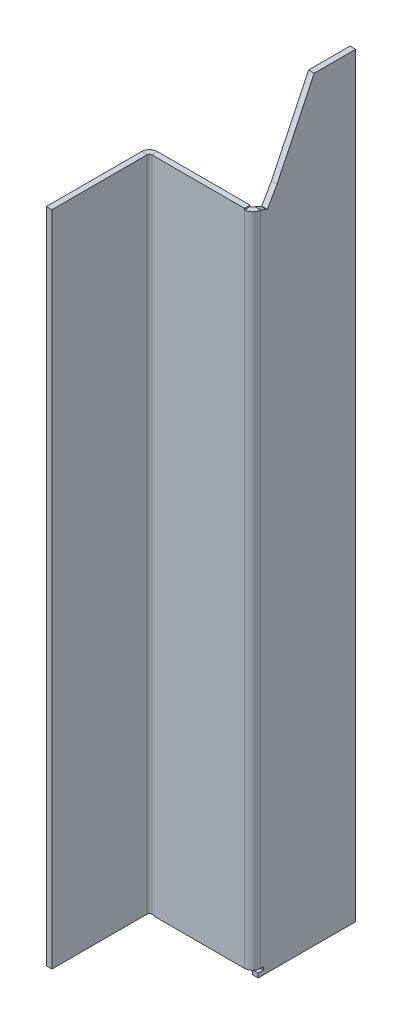
ISO-10303-21;
HEADER;
FILE_DESCRIPTION(('STEP AP214'),'2;1');
FILE_NAME('part.step','',(''),(''),'','','');
FILE_SCHEMA(('AUTOMOTIVE_DESIGN { 1 0 10303 214 1 1 1 1 }'));
ENDSEC;
DATA;
#1=APPLICATION_CONTEXT('core data for automotive mechanical design processes');
#2=APPLICATION_PROTOCOL_DEFINITION('international standard','automotive_design',2000,#1);
#3=PRODUCT_CONTEXT('',#1,'mechanical');
#4=PRODUCT('Part','Part','',(#3));
#5=PRODUCT_RELATED_PRODUCT_CATEGORY('part','',(#4));
#6=PRODUCT_DEFINITION_FORMATION('','',#4);
#7=PRODUCT_DEFINITION_CONTEXT('part definition',#1,'design');
#8=PRODUCT_DEFINITION('design','',#6,#7);
#9=PRODUCT_DEFINITION_SHAPE('','',#8);
#10=(LENGTH_UNIT() NAMED_UNIT(*) SI_UNIT(.MILLI.,.METRE.));
#11=(NAMED_UNIT(*) PLANE_ANGLE_UNIT() SI_UNIT($,.RADIAN.));
#12=(NAMED_UNIT(*) SI_UNIT($,.STERADIAN.) SOLID_ANGLE_UNIT());
#13=UNCERTAINTY_MEASURE_WITH_UNIT(LENGTH_MEASURE(1.E-05),#10,'distance_accuracy_value','');
#14=(GEOMETRIC_REPRESENTATION_CONTEXT(3) GLOBAL_UNCERTAINTY_ASSIGNED_CONTEXT((#13)) GLOBAL_UNIT_ASSIGNED_CONTEXT((#10,
#11,#12)) REPRESENTATION_CONTEXT('',''));
#15=CARTESIAN_POINT('',(0.,0.,0.));
#16=DIRECTION('',(0.,0.,1.));
#17=DIRECTION('',(1.,0.,0.));
#18=AXIS2_PLACEMENT_3D('',#15,#16,#17);
#19=CARTESIAN_POINT('',(-31.9366,89.,16.8527491419913));
#20=DIRECTION('',(0.,-1.,0.));
#21=DIRECTION('',(0.,0.,-1.));
#22=AXIS2_PLACEMENT_3D('',#19,#20,#21);
#23=PLANE('',#22);
#24=DIRECTION('',(0.,0.,-1.));
#25=VECTOR('',#24,1.);
#26=CARTESIAN_POINT('',(-31.2,89.,16.8527491419913));
#27=LINE('',#26,#25);
#28=CARTESIAN_POINT('',(-31.2,89.,16.8527491419913));
#29=VERTEX_POINT('',#28);
#30=CARTESIAN_POINT('',(-31.2,89.,15.1161491419913));
#31=VERTEX_POINT('',#30);
#32=EDGE_CURVE('E251',#29,#31,#27,.T.);
#33=ORIENTED_EDGE('',*,*,#32,.F.);
#34=DIRECTION('',(-1.,0.,0.));
#35=VECTOR('',#34,1.);
#36=CARTESIAN_POINT('',(-31.9366,89.,16.8527491419913));
#37=LINE('',#36,#35);
#38=CARTESIAN_POINT('',(-2.4732,89.,16.8527491419912));
#39=VERTEX_POINT('',#38);
#40=EDGE_CURVE('E276',#39,#29,#37,.T.);
#41=ORIENTED_EDGE('',*,*,#40,.F.);
#42=DIRECTION('',(0.,0.,1.));
#43=VECTOR('',#42,1.);
#44=CARTESIAN_POINT('',(-2.4732,89.,15.1161491419912));
#45=LINE('',#44,#43);
#46=CARTESIAN_POINT('',(-2.4732,89.,15.1161491419912));
#47=VERTEX_POINT('',#46);
#48=EDGE_CURVE('E268',#47,#39,#45,.T.);
#49=ORIENTED_EDGE('',*,*,#48,.F.);
#50=DIRECTION('',(-1.,0.,0.));
#51=VECTOR('',#50,1.);
#52=CARTESIAN_POINT('',(-31.9366,89.,15.1161491419913));
#53=LINE('',#52,#51);
#54=EDGE_CURVE('E275',#47,#31,#53,.T.);
#55=ORIENTED_EDGE('',*,*,#54,.T.);
#56=EDGE_LOOP('',(#33,#41,#49,#55));
#57=FACE_BOUND('',#56,.T.);
#58=ADVANCED_FACE('F39',(#57),#23,.F.);
#59=CARTESIAN_POINT('',(-1.73659999999996,-114.862531118843,16.8527491419912));
#60=DIRECTION('',(0.,1.,0.));
#61=DIRECTION('',(0.,0.,1.));
#62=AXIS2_PLACEMENT_3D('',#59,#60,#61);
#63=PLANE('',#62);
#64=DIRECTION('',(0.,0.,1.));
#65=VECTOR('',#64,1.);
#66=CARTESIAN_POINT('',(-30.3317,-114.862531118843,16.8527491419912));
#67=LINE('',#66,#65);
#68=CARTESIAN_POINT('',(-30.3317,-114.862531118843,15.1161491419913));
#69=VERTEX_POINT('',#68);
#70=CARTESIAN_POINT('',(-30.3317,-114.862531118843,16.8527491419913));
#71=VERTEX_POINT('',#70);
#72=EDGE_CURVE('E257',#69,#71,#67,.T.);
#73=ORIENTED_EDGE('',*,*,#72,.F.);
#74=DIRECTION('',(1.,0.,0.));
#75=VECTOR('',#74,1.);
#76=CARTESIAN_POINT('',(-1.73659999999996,-114.862531118843,15.1161491419912));
#77=LINE('',#76,#75);
#78=CARTESIAN_POINT('',(-2.47319999999998,-114.862531118843,15.1161491419912));
#79=VERTEX_POINT('',#78);
#80=EDGE_CURVE('E280',#69,#79,#77,.T.);
#81=ORIENTED_EDGE('',*,*,#80,.T.);
#82=DIRECTION('',(0.,0.,1.));
#83=VECTOR('',#82,1.);
#84=CARTESIAN_POINT('',(-2.47319999999996,-114.862531118843,15.1161491419912));
#85=LINE('',#84,#83);
#86=CARTESIAN_POINT('',(-2.47319999999996,-114.862531118843,16.8527491419912));
#87=VERTEX_POINT('',#86);
#88=EDGE_CURVE('E264',#79,#87,#85,.T.);
#89=ORIENTED_EDGE('',*,*,#88,.T.);
#90=DIRECTION('',(1.,0.,0.));
#91=VECTOR('',#90,1.);
#92=CARTESIAN_POINT('',(-1.73659999999996,-114.862531118843,16.8527491419912));
#93=LINE('',#92,#91);
#94=EDGE_CURVE('E279',#71,#87,#93,.T.);
#95=ORIENTED_EDGE('',*,*,#94,.F.);
#96=EDGE_LOOP('',(#73,#81,#89,#95));
#97=FACE_BOUND('',#96,.T.);
#98=ADVANCED_FACE('F416',(#97),#63,.F.);
#99=CARTESIAN_POINT('',(0.,0.,16.8527491419912));
#100=DIRECTION('',(0.,0.,-1.));
#101=DIRECTION('',(-1.,0.,0.));
#102=AXIS2_PLACEMENT_3D('',#99,#100,#101);
#103=PLANE('',#102);
#104=DIRECTION('',(0.,1.,0.));
#105=VECTOR('',#104,1.);
#106=CARTESIAN_POINT('',(-30.3317,-115.530831118843,16.8527491419913));
#107=LINE('',#106,#105);
#108=CARTESIAN_POINT('',(-30.3317,-114.662531118843,16.8527491419913));
#109=VERTEX_POINT('',#108);
#110=EDGE_CURVE('E255',#71,#109,#107,.T.);
#111=ORIENTED_EDGE('',*,*,#110,.F.);
#112=ORIENTED_EDGE('',*,*,#94,.T.);
#113=DIRECTION('',(0.,1.,0.));
#114=VECTOR('',#113,1.);
#115=CARTESIAN_POINT('',(-2.47319999999997,88.5941398939917,16.8527491419912));
#116=LINE('',#115,#114);
#117=CARTESIAN_POINT('',(-2.47319999999997,88.5941398939917,16.8527491419912));
#118=VERTEX_POINT('',#117);
#119=EDGE_CURVE('E293',#87,#118,#116,.T.);
#120=ORIENTED_EDGE('',*,*,#119,.T.);
#121=DIRECTION('',(0.,-1.,0.));
#122=VECTOR('',#121,1.);
#123=CARTESIAN_POINT('',(-2.47319999999998,0.,16.8527491419912));
#124=LINE('',#123,#122);
#125=EDGE_CURVE('E271',#39,#118,#124,.T.);
#126=ORIENTED_EDGE('',*,*,#125,.F.);
#127=ORIENTED_EDGE('',*,*,#40,.T.);
#128=DIRECTION('',(0.,-1.,0.));
#129=VECTOR('',#128,1.);
#130=CARTESIAN_POINT('',(-31.2,-114.662531118843,16.8527491419913));
#131=LINE('',#130,#129);
#132=CARTESIAN_POINT('',(-31.2,-114.662531118843,16.8527491419913));
#133=VERTEX_POINT('',#132);
#134=EDGE_CURVE('E248',#133,#29,#131,.F.);
#135=ORIENTED_EDGE('',*,*,#134,.F.);
#136=DIRECTION('',(-1.,0.,0.));
#137=VECTOR('',#136,1.);
#138=CARTESIAN_POINT('',(-30.3317,-114.662531118843,16.8527491419913));
#139=LINE('',#138,#137);
#140=EDGE_CURVE('E258',#109,#133,#139,.T.);
#141=ORIENTED_EDGE('',*,*,#140,.F.);
#142=EDGE_LOOP('',(#111,#112,#120,#126,#127,#135,#141));
#143=FACE_BOUND('',#142,.T.);
#144=ADVANCED_FACE('F413',(#143),#103,.F.);
#145=CARTESIAN_POINT('',(0.,0.,15.1161491419912));
#146=DIRECTION('',(0.,0.,-1.));
#147=DIRECTION('',(-1.,0.,0.));
#148=AXIS2_PLACEMENT_3D('',#145,#146,#147);
#149=PLANE('',#148);
#150=ORIENTED_EDGE('',*,*,#80,.F.);
#151=DIRECTION('',(0.,1.,0.));
#152=VECTOR('',#151,1.);
#153=CARTESIAN_POINT('',(-30.3317,0.,15.1161491419913));
#154=LINE('',#153,#152);
#155=CARTESIAN_POINT('',(-30.3317,-114.662531118843,15.1161491419913));
#156=VERTEX_POINT('',#155);
#157=EDGE_CURVE('E11',#69,#156,#154,.T.);
#158=ORIENTED_EDGE('',*,*,#157,.T.);
#159=DIRECTION('',(-1.,0.,0.));
#160=VECTOR('',#159,1.);
#161=CARTESIAN_POINT('',(0.,-114.662531118843,15.1161491419912));
#162=LINE('',#161,#160);
#163=CARTESIAN_POINT('',(-31.2,-114.662531118843,15.1161491419913));
#164=VERTEX_POINT('',#163);
#165=EDGE_CURVE('E47',#156,#164,#162,.T.);
#166=ORIENTED_EDGE('',*,*,#165,.T.);
#167=DIRECTION('',(0.,-1.,0.));
#168=VECTOR('',#167,1.);
#169=CARTESIAN_POINT('',(-31.2,-114.662531118843,15.1161491419913));
#170=LINE('',#169,#168);
#171=EDGE_CURVE('E198',#164,#31,#170,.F.);
#172=ORIENTED_EDGE('',*,*,#171,.T.);
#173=ORIENTED_EDGE('',*,*,#54,.F.);
#174=DIRECTION('',(0.,1.,0.));
#175=VECTOR('',#174,1.);
#176=CARTESIAN_POINT('',(-2.47319999999996,-114.862531118843,15.1161491419912));
#177=LINE('',#176,#175);
#178=CARTESIAN_POINT('',(-2.4732,88.5941398939917,15.1161491419912));
#179=VERTEX_POINT('',#178);
#180=EDGE_CURVE('E269',#179,#47,#177,.T.);
#181=ORIENTED_EDGE('',*,*,#180,.F.);
#182=EDGE_CURVE('E265',#79,#179,#177,.T.);
#183=ORIENTED_EDGE('',*,*,#182,.F.);
#184=EDGE_LOOP('',(#150,#158,#166,#172,#173,#181,#183));
#185=FACE_BOUND('',#184,.T.);
#186=ADVANCED_FACE('F401',(#185),#149,.T.);
#187=CARTESIAN_POINT('',(-1.7366,-117.062531118843,15.1161491419912));
#188=DIRECTION('',(0.,0.,1.));
#189=DIRECTION('',(1.,0.,0.));
#190=AXIS2_PLACEMENT_3D('',#187,#188,#189);
#191=PLANE('',#190);
#192=DIRECTION('',(0.,-1.,0.));
#193=VECTOR('',#192,1.);
#194=CARTESIAN_POINT('',(0.,-117.062531118843,15.1161491419912));
#195=LINE('',#194,#193);
#196=CARTESIAN_POINT('',(0.,-115.730831118843,15.1161491419912));
#197=VERTEX_POINT('',#196);
#198=CARTESIAN_POINT('',(0.,-117.062531118843,15.1161491419912));
#199=VERTEX_POINT('',#198);
#200=EDGE_CURVE('E372',#197,#199,#195,.T.);
#201=ORIENTED_EDGE('',*,*,#200,.F.);
#202=DIRECTION('',(1.,0.,0.));
#203=VECTOR('',#202,1.);
#204=CARTESIAN_POINT('',(-1.73659999999998,-115.730831118843,15.1161491419912));
#205=LINE('',#204,#203);
#206=CARTESIAN_POINT('',(-1.7366,-115.730831118843,15.1161491419912));
#207=VERTEX_POINT('',#206);
#208=EDGE_CURVE('E324',#207,#197,#205,.T.);
#209=ORIENTED_EDGE('',*,*,#208,.F.);
#210=DIRECTION('',(0.,-1.,0.));
#211=VECTOR('',#210,1.);
#212=CARTESIAN_POINT('',(-1.7366,-117.062531118843,15.1161491419912));
#213=LINE('',#212,#211);
#214=CARTESIAN_POINT('',(-1.7366,-117.062531118843,15.1161491419912));
#215=VERTEX_POINT('',#214);
#216=EDGE_CURVE('E350',#207,#215,#213,.T.);
#217=ORIENTED_EDGE('',*,*,#216,.T.);
#218=DIRECTION('',(1.,0.,0.));
#219=VECTOR('',#218,1.);
#220=CARTESIAN_POINT('',(-1.7366,-117.062531118843,15.1161491419912));
#221=LINE('',#220,#219);
#222=EDGE_CURVE('E379',#215,#199,#221,.T.);
#223=ORIENTED_EDGE('',*,*,#222,.T.);
#224=EDGE_LOOP('',(#201,#209,#217,#223));
#225=FACE_BOUND('',#224,.T.);
#226=ADVANCED_FACE('F514',(#225),#191,.T.);
#227=CARTESIAN_POINT('',(-1.7366,87.6777832599046,12.429418015997));
#228=DIRECTION('',(0.,0.905060323174692,-0.425283213182605));
#229=DIRECTION('',(0.,0.425283213182605,0.905060323174693));
#230=AXIS2_PLACEMENT_3D('',#227,#228,#229);
#231=PLANE('',#230);
#232=DIRECTION('',(0.,0.425283213182605,0.905060323174693));
#233=VECTOR('',#232,1.);
#234=CARTESIAN_POINT('',(-1.7366,87.6777832599046,12.429418015997));
#235=LINE('',#234,#233);
#236=CARTESIAN_POINT('',(-1.7366,87.6777832599046,12.429418015997));
#237=VERTEX_POINT('',#236);
#238=CARTESIAN_POINT('',(-1.7366,88.5941398939917,14.3795491419912));
#239=VERTEX_POINT('',#238);
#240=EDGE_CURVE('E347',#237,#239,#235,.T.);
#241=ORIENTED_EDGE('',*,*,#240,.T.);
#242=DIRECTION('',(1.,0.,0.));
#243=VECTOR('',#242,1.);
#244=CARTESIAN_POINT('',(-1.73659999999995,88.5941398939917,14.3795491419912));
#245=LINE('',#244,#243);
#246=CARTESIAN_POINT('',(0.,88.5941398939917,14.3795491419912));
#247=VERTEX_POINT('',#246);
#248=EDGE_CURVE('E292',#239,#247,#245,.T.);
#249=ORIENTED_EDGE('',*,*,#248,.T.);
#250=DIRECTION('',(0.,0.425283213182605,0.905060323174693));
#251=VECTOR('',#250,1.);
#252=CARTESIAN_POINT('',(0.,87.6777832599046,12.429418015997));
#253=LINE('',#252,#251);
#254=CARTESIAN_POINT('',(0.,87.6777832599046,12.429418015997));
#255=VERTEX_POINT('',#254);
#256=EDGE_CURVE('E370',#255,#247,#253,.T.);
#257=ORIENTED_EDGE('',*,*,#256,.F.);
#258=DIRECTION('',(1.,0.,0.));
#259=VECTOR('',#258,1.);
#260=CARTESIAN_POINT('',(-1.7366,87.6777832599046,12.429418015997));
#261=LINE('',#260,#259);
#262=EDGE_CURVE('E382',#237,#255,#261,.T.);
#263=ORIENTED_EDGE('',*,*,#262,.F.);
#264=EDGE_LOOP('',(#241,#249,#257,#263));
#265=FACE_BOUND('',#264,.T.);
#266=ADVANCED_FACE('F439',(#265),#231,.T.);
#267=CARTESIAN_POINT('',(-1.7366,0.,0.));
#268=DIRECTION('',(-1.,0.,0.));
#269=DIRECTION('',(0.,0.,1.));
#270=AXIS2_PLACEMENT_3D('',#267,#268,#269);
#271=PLANE('',#270);
#272=DIRECTION('',(0.,0.,-1.));
#273=VECTOR('',#272,1.);
#274=CARTESIAN_POINT('',(-1.73659999999995,-114.862531118843,14.3795491419912));
#275=LINE('',#274,#273);
#276=CARTESIAN_POINT('',(-1.7366,-114.862531118843,14.3795491419912));
#277=VERTEX_POINT('',#276);
#278=CARTESIAN_POINT('',(-1.7366,-114.862531118843,13.5112491419912));
#279=VERTEX_POINT('',#278);
#280=EDGE_CURVE('E62',#277,#279,#275,.T.);
#281=ORIENTED_EDGE('',*,*,#280,.F.);
#282=DIRECTION('',(0.,1.,0.));
#283=VECTOR('',#282,1.);
#284=CARTESIAN_POINT('',(-1.73659999999995,88.5941398939917,14.3795491419912));
#285=LINE('',#284,#283);
#286=EDGE_CURVE('E301',#239,#277,#285,.F.);
#287=ORIENTED_EDGE('',*,*,#286,.F.);
#288=ORIENTED_EDGE('',*,*,#240,.F.);
#289=DIRECTION('',(0.,0.13938622121451,0.990238093256132));
#290=VECTOR('',#289,1.);
#291=CARTESIAN_POINT('',(-1.7366,87.6560709520587,12.275167802926));
#292=LINE('',#291,#290);
#293=CARTESIAN_POINT('',(-1.7366,87.6560709520587,12.275167802926));
#294=VERTEX_POINT('',#293);
#295=EDGE_CURVE('E344',#294,#237,#292,.T.);
#296=ORIENTED_EDGE('',*,*,#295,.F.);
#297=DIRECTION('',(0.,-0.867078286675618,0.498171902836436));
#298=VECTOR('',#297,1.);
#299=CARTESIAN_POINT('',(-1.7366,92.9042264348046,9.25988804860881));
#300=LINE('',#299,#298);
#301=CARTESIAN_POINT('',(-1.7366,92.9042264348046,9.25988804860881));
#302=VERTEX_POINT('',#301);
#303=EDGE_CURVE('E341',#302,#294,#300,.T.);
#304=ORIENTED_EDGE('',*,*,#303,.F.);
#305=DIRECTION('',(0.,-0.90185435907009,0.432040177560233));
#306=VECTOR('',#305,1.);
#307=CARTESIAN_POINT('',(-1.7366,116.937468881157,-2.2534192048779));
#308=LINE('',#307,#306);
#309=CARTESIAN_POINT('',(-1.7366,116.937468881157,-2.2534192048779));
#310=VERTEX_POINT('',#309);
#311=EDGE_CURVE('E338',#310,#302,#308,.T.);
#312=ORIENTED_EDGE('',*,*,#311,.F.);
#313=DIRECTION('',(0.,0.,1.));
#314=VECTOR('',#313,1.);
#315=CARTESIAN_POINT('',(-1.7366,116.937468881157,-2.2534192048779));
#316=LINE('',#315,#314);
#317=CARTESIAN_POINT('',(-1.7366,116.937468881157,-15.1));
#318=VERTEX_POINT('',#317);
#319=EDGE_CURVE('E334',#318,#310,#316,.T.);
#320=ORIENTED_EDGE('',*,*,#319,.F.);
#321=DIRECTION('',(0.,1.,0.));
#322=VECTOR('',#321,1.);
#323=CARTESIAN_POINT('',(-1.7366,-117.062531118843,-15.1));
#324=LINE('',#323,#322);
#325=CARTESIAN_POINT('',(-1.7366,-117.062531118843,-15.1));
#326=VERTEX_POINT('',#325);
#327=EDGE_CURVE('E331',#326,#318,#324,.T.);
#328=ORIENTED_EDGE('',*,*,#327,.F.);
#329=DIRECTION('',(0.,0.,-1.));
#330=VECTOR('',#329,1.);
#331=CARTESIAN_POINT('',(-1.7366,-117.062531118843,15.1161491419912));
#332=LINE('',#331,#330);
#333=EDGE_CURVE('E352',#215,#326,#332,.T.);
#334=ORIENTED_EDGE('',*,*,#333,.F.);
#335=ORIENTED_EDGE('',*,*,#216,.F.);
#336=DIRECTION('',(0.,0.,1.));
#337=VECTOR('',#336,1.);
#338=CARTESIAN_POINT('',(-1.73659999999995,-115.730831118843,13.5112491419912));
#339=LINE('',#338,#337);
#340=CARTESIAN_POINT('',(-1.7366,-115.730831118843,13.5112491419912));
#341=VERTEX_POINT('',#340);
#342=EDGE_CURVE('E321',#341,#207,#339,.T.);
#343=ORIENTED_EDGE('',*,*,#342,.F.);
#344=DIRECTION('',(0.,-1.,0.));
#345=VECTOR('',#344,1.);
#346=CARTESIAN_POINT('',(-1.73659999999995,-114.862531118843,13.5112491419912));
#347=LINE('',#346,#345);
#348=EDGE_CURVE('E317',#279,#341,#347,.T.);
#349=ORIENTED_EDGE('',*,*,#348,.F.);
#350=EDGE_LOOP('',(#281,#287,#288,#296,#304,#312,#320,#328,#334,#335,#343,#349));
#351=FACE_BOUND('',#350,.T.);
#352=ADVANCED_FACE('F435',(#351),#271,.T.);
#353=CARTESIAN_POINT('',(0.,0.,0.));
#354=DIRECTION('',(-1.,0.,0.));
#355=DIRECTION('',(0.,0.,1.));
#356=AXIS2_PLACEMENT_3D('',#353,#354,#355);
#357=PLANE('',#356);
#358=DIRECTION('',(0.,1.,0.));
#359=VECTOR('',#358,1.);
#360=CARTESIAN_POINT('',(0.,88.5941398939917,14.3795491419912));
#361=LINE('',#360,#359);
#362=CARTESIAN_POINT('',(0.,-114.862531118843,14.3795491419912));
#363=VERTEX_POINT('',#362);
#364=EDGE_CURVE('E286',#247,#363,#361,.F.);
#365=ORIENTED_EDGE('',*,*,#364,.T.);
#366=DIRECTION('',(0.,0.,1.));
#367=VECTOR('',#366,1.);
#368=CARTESIAN_POINT('',(0.,-114.862531118843,0.));
#369=LINE('',#368,#367);
#370=CARTESIAN_POINT('',(0.,-114.862531118843,13.5112491419912));
#371=VERTEX_POINT('',#370);
#372=EDGE_CURVE('E396',#371,#363,#369,.T.);
#373=ORIENTED_EDGE('',*,*,#372,.F.);
#374=DIRECTION('',(0.,1.,0.));
#375=VECTOR('',#374,1.);
#376=CARTESIAN_POINT('',(0.,0.,13.5112491419912));
#377=LINE('',#376,#375);
#378=CARTESIAN_POINT('',(0.,-115.730831118843,13.5112491419912));
#379=VERTEX_POINT('',#378);
#380=EDGE_CURVE('E393',#379,#371,#377,.T.);
#381=ORIENTED_EDGE('',*,*,#380,.F.);
#382=DIRECTION('',(0.,0.,-1.));
#383=VECTOR('',#382,1.);
#384=CARTESIAN_POINT('',(0.,-115.730831118843,0.));
#385=LINE('',#384,#383);
#386=EDGE_CURVE('E378',#197,#379,#385,.T.);
#387=ORIENTED_EDGE('',*,*,#386,.F.);
#388=ORIENTED_EDGE('',*,*,#200,.T.);
#389=DIRECTION('',(0.,0.,-1.));
#390=VECTOR('',#389,1.);
#391=CARTESIAN_POINT('',(0.,-117.062531118843,15.1161491419912));
#392=LINE('',#391,#390);
#393=CARTESIAN_POINT('',(0.,-117.062531118843,-15.1));
#394=VERTEX_POINT('',#393);
#395=EDGE_CURVE('E335',#199,#394,#392,.T.);
#396=ORIENTED_EDGE('',*,*,#395,.T.);
#397=DIRECTION('',(0.,1.,0.));
#398=VECTOR('',#397,1.);
#399=CARTESIAN_POINT('',(0.,-117.062531118843,-15.1));
#400=LINE('',#399,#398);
#401=CARTESIAN_POINT('',(0.,116.937468881157,-15.1));
#402=VERTEX_POINT('',#401);
#403=EDGE_CURVE('E316',#394,#402,#400,.T.);
#404=ORIENTED_EDGE('',*,*,#403,.T.);
#405=DIRECTION('',(0.,0.,1.));
#406=VECTOR('',#405,1.);
#407=CARTESIAN_POINT('',(0.,116.937468881157,-2.2534192048779));
#408=LINE('',#407,#406);
#409=CARTESIAN_POINT('',(0.,116.937468881157,-2.2534192048779));
#410=VERTEX_POINT('',#409);
#411=EDGE_CURVE('E358',#402,#410,#408,.T.);
#412=ORIENTED_EDGE('',*,*,#411,.T.);
#413=DIRECTION('',(0.,-0.90185435907009,0.432040177560233));
#414=VECTOR('',#413,1.);
#415=CARTESIAN_POINT('',(0.,116.937468881157,-2.2534192048779));
#416=LINE('',#415,#414);
#417=CARTESIAN_POINT('',(0.,92.9042264348046,9.25988804860881));
#418=VERTEX_POINT('',#417);
#419=EDGE_CURVE('E361',#410,#418,#416,.T.);
#420=ORIENTED_EDGE('',*,*,#419,.T.);
#421=DIRECTION('',(0.,-0.867078286675618,0.498171902836436));
#422=VECTOR('',#421,1.);
#423=CARTESIAN_POINT('',(0.,92.9042264348046,9.25988804860881));
#424=LINE('',#423,#422);
#425=CARTESIAN_POINT('',(0.,87.6560709520587,12.275167802926));
#426=VERTEX_POINT('',#425);
#427=EDGE_CURVE('E364',#418,#426,#424,.T.);
#428=ORIENTED_EDGE('',*,*,#427,.T.);
#429=DIRECTION('',(0.,0.13938622121451,0.990238093256132));
#430=VECTOR('',#429,1.);
#431=CARTESIAN_POINT('',(0.,87.6560709520587,12.275167802926));
#432=LINE('',#431,#430);
#433=EDGE_CURVE('E367',#426,#255,#432,.T.);
#434=ORIENTED_EDGE('',*,*,#433,.T.);
#435=ORIENTED_EDGE('',*,*,#256,.T.);
#436=EDGE_LOOP('',(#365,#373,#381,#387,#388,#396,#404,#412,#420,#428,#434,#435));
#437=FACE_BOUND('',#436,.T.);
#438=ADVANCED_FACE('F505',(#437),#357,.F.);
#439=CARTESIAN_POINT('',(-1.7366,-117.062531118843,-15.1));
#440=DIRECTION('',(0.,0.,-1.));
#441=DIRECTION('',(-1.,0.,0.));
#442=AXIS2_PLACEMENT_3D('',#439,#440,#441);
#443=PLANE('',#442);
#444=ORIENTED_EDGE('',*,*,#403,.F.);
#445=DIRECTION('',(1.,0.,0.));
#446=VECTOR('',#445,1.);
#447=CARTESIAN_POINT('',(-1.7366,-117.062531118843,-15.1));
#448=LINE('',#447,#446);
#449=EDGE_CURVE('E376',#326,#394,#448,.T.);
#450=ORIENTED_EDGE('',*,*,#449,.F.);
#451=ORIENTED_EDGE('',*,*,#327,.T.);
#452=DIRECTION('',(1.,0.,0.));
#453=VECTOR('',#452,1.);
#454=CARTESIAN_POINT('',(-1.7366,116.937468881157,-15.1));
#455=LINE('',#454,#453);
#456=EDGE_CURVE('E355',#318,#402,#455,.T.);
#457=ORIENTED_EDGE('',*,*,#456,.T.);
#458=EDGE_LOOP('',(#444,#450,#451,#457));
#459=FACE_BOUND('',#458,.T.);
#460=ADVANCED_FACE('F41',(#459),#443,.T.);
#461=CARTESIAN_POINT('',(-1.7366,-117.062531118843,15.1161491419912));
#462=DIRECTION('',(0.,-1.,0.));
#463=DIRECTION('',(0.,0.,-1.));
#464=AXIS2_PLACEMENT_3D('',#461,#462,#463);
#465=PLANE('',#464);
#466=ORIENTED_EDGE('',*,*,#395,.F.);
#467=ORIENTED_EDGE('',*,*,#222,.F.);
#468=ORIENTED_EDGE('',*,*,#333,.T.);
#469=ORIENTED_EDGE('',*,*,#449,.T.);
#470=EDGE_LOOP('',(#466,#467,#468,#469));
#471=FACE_BOUND('',#470,.T.);
#472=ADVANCED_FACE('F509',(#471),#465,.T.);
#473=CARTESIAN_POINT('',(-1.7366,87.6560709520587,12.275167802926));
#474=DIRECTION('',(0.,0.990238093256132,-0.13938622121451));
#475=DIRECTION('',(0.,0.13938622121451,0.990238093256132));
#476=AXIS2_PLACEMENT_3D('',#473,#474,#475);
#477=PLANE('',#476);
#478=ORIENTED_EDGE('',*,*,#433,.F.);
#479=DIRECTION('',(1.,0.,0.));
#480=VECTOR('',#479,1.);
#481=CARTESIAN_POINT('',(-1.7366,87.6560709520587,12.275167802926));
#482=LINE('',#481,#480);
#483=EDGE_CURVE('E384',#294,#426,#482,.T.);
#484=ORIENTED_EDGE('',*,*,#483,.F.);
#485=ORIENTED_EDGE('',*,*,#295,.T.);
#486=ORIENTED_EDGE('',*,*,#262,.T.);
#487=EDGE_LOOP('',(#478,#484,#485,#486));
#488=FACE_BOUND('',#487,.T.);
#489=ADVANCED_FACE('F512',(#488),#477,.T.);
#490=CARTESIAN_POINT('',(-1.7366,92.9042264348046,9.25988804860881));
#491=DIRECTION('',(0.,0.498171902836436,0.867078286675618));
#492=DIRECTION('',(0.,-0.867078286675618,0.498171902836436));
#493=AXIS2_PLACEMENT_3D('',#490,#491,#492);
#494=PLANE('',#493);
#495=ORIENTED_EDGE('',*,*,#427,.F.);
#496=DIRECTION('',(1.,0.,0.));
#497=VECTOR('',#496,1.);
#498=CARTESIAN_POINT('',(-1.7366,92.9042264348046,9.25988804860881));
#499=LINE('',#498,#497);
#500=EDGE_CURVE('E386',#302,#418,#499,.T.);
#501=ORIENTED_EDGE('',*,*,#500,.F.);
#502=ORIENTED_EDGE('',*,*,#303,.T.);
#503=ORIENTED_EDGE('',*,*,#483,.T.);
#504=EDGE_LOOP('',(#495,#501,#502,#503));
#505=FACE_BOUND('',#504,.T.);
#506=ADVANCED_FACE('F522',(#505),#494,.T.);
#507=CARTESIAN_POINT('',(-1.7366,116.937468881157,-2.2534192048779));
#508=DIRECTION('',(0.,0.432040177560233,0.90185435907009));
#509=DIRECTION('',(0.,-0.90185435907009,0.432040177560233));
#510=AXIS2_PLACEMENT_3D('',#507,#508,#509);
#511=PLANE('',#510);
#512=ORIENTED_EDGE('',*,*,#419,.F.);
#513=DIRECTION('',(1.,0.,0.));
#514=VECTOR('',#513,1.);
#515=CARTESIAN_POINT('',(-1.7366,116.937468881157,-2.2534192048779));
#516=LINE('',#515,#514);
#517=EDGE_CURVE('E388',#310,#410,#516,.T.);
#518=ORIENTED_EDGE('',*,*,#517,.F.);
#519=ORIENTED_EDGE('',*,*,#311,.T.);
#520=ORIENTED_EDGE('',*,*,#500,.T.);
#521=EDGE_LOOP('',(#512,#518,#519,#520));
#522=FACE_BOUND('',#521,.T.);
#523=ADVANCED_FACE('F526',(#522),#511,.T.);
#524=CARTESIAN_POINT('',(-1.7366,116.937468881157,-2.2534192048779));
#525=DIRECTION('',(0.,1.,0.));
#526=DIRECTION('',(0.,0.,1.));
#527=AXIS2_PLACEMENT_3D('',#524,#525,#526);
#528=PLANE('',#527);
#529=ORIENTED_EDGE('',*,*,#411,.F.);
#530=ORIENTED_EDGE('',*,*,#456,.F.);
#531=ORIENTED_EDGE('',*,*,#319,.T.);
#532=ORIENTED_EDGE('',*,*,#517,.T.);
#533=EDGE_LOOP('',(#529,#530,#531,#532));
#534=FACE_BOUND('',#533,.T.);
#535=ADVANCED_FACE('F502',(#534),#528,.T.);
#536=CARTESIAN_POINT('',(-1.73659999999995,-114.862531118843,14.3795491419912));
#537=DIRECTION('',(0.,-1.,0.));
#538=DIRECTION('',(0.,0.,-1.));
#539=AXIS2_PLACEMENT_3D('',#536,#537,#538);
#540=PLANE('',#539);
#541=DIRECTION('',(1.,0.,0.));
#542=VECTOR('',#541,1.);
#543=CARTESIAN_POINT('',(-1.73659999999995,-114.862531118843,13.5112491419912));
#544=LINE('',#543,#542);
#545=EDGE_CURVE('E320',#279,#371,#544,.T.);
#546=ORIENTED_EDGE('',*,*,#545,.T.);
#547=ORIENTED_EDGE('',*,*,#372,.T.);
#548=DIRECTION('',(1.,0.,0.));
#549=VECTOR('',#548,1.);
#550=CARTESIAN_POINT('',(-1.73659999999995,-114.862531118843,14.3795491419912));
#551=LINE('',#550,#549);
#552=EDGE_CURVE('E306',#277,#363,#551,.T.);
#553=ORIENTED_EDGE('',*,*,#552,.F.);
#554=ORIENTED_EDGE('',*,*,#280,.T.);
#555=EDGE_LOOP('',(#546,#547,#553,#554));
#556=FACE_BOUND('',#555,.T.);
#557=ADVANCED_FACE('F430',(#556),#540,.T.);
#558=CARTESIAN_POINT('',(-1.73659999999995,-114.862531118843,13.5112491419912));
#559=DIRECTION('',(0.,0.,1.));
#560=DIRECTION('',(1.,0.,0.));
#561=AXIS2_PLACEMENT_3D('',#558,#559,#560);
#562=PLANE('',#561);
#563=DIRECTION('',(1.,0.,0.));
#564=VECTOR('',#563,1.);
#565=CARTESIAN_POINT('',(-1.73659999999995,-115.730831118843,13.5112491419912));
#566=LINE('',#565,#564);
#567=EDGE_CURVE('E312',#341,#379,#566,.T.);
#568=ORIENTED_EDGE('',*,*,#567,.T.);
#569=ORIENTED_EDGE('',*,*,#380,.T.);
#570=ORIENTED_EDGE('',*,*,#545,.F.);
#571=ORIENTED_EDGE('',*,*,#348,.T.);
#572=EDGE_LOOP('',(#568,#569,#570,#571));
#573=FACE_BOUND('',#572,.T.);
#574=ADVANCED_FACE('F495',(#573),#562,.T.);
#575=CARTESIAN_POINT('',(-1.73659999999995,-115.730831118843,13.5112491419912));
#576=DIRECTION('',(0.,1.,0.));
#577=DIRECTION('',(0.,0.,1.));
#578=AXIS2_PLACEMENT_3D('',#575,#576,#577);
#579=PLANE('',#578);
#580=ORIENTED_EDGE('',*,*,#208,.T.);
#581=ORIENTED_EDGE('',*,*,#386,.T.);
#582=ORIENTED_EDGE('',*,*,#567,.F.);
#583=ORIENTED_EDGE('',*,*,#342,.T.);
#584=EDGE_LOOP('',(#580,#581,#582,#583));
#585=FACE_BOUND('',#584,.T.);
#586=ADVANCED_FACE('F490',(#585),#579,.T.);
#587=CARTESIAN_POINT('',(-2.47319999999998,-114.862531118843,14.3795491419912));
#588=DIRECTION('',(0.,-1.,0.));
#589=DIRECTION('',(0.,0.,-1.));
#590=AXIS2_PLACEMENT_3D('',#587,#588,#589);
#591=PLANE('',#590);
#592=ORIENTED_EDGE('',*,*,#88,.F.);
#593=CARTESIAN_POINT('',(-2.47319999999998,-114.862531118843,14.3795491419912));
#594=DIRECTION('',(0.,1.,0.));
#595=DIRECTION('',(0.,0.,1.));
#596=AXIS2_PLACEMENT_3D('',#593,#594,#595);
#597=CIRCLE('',#596,0.736600000000025);
#598=EDGE_CURVE('E296',#277,#79,#597,.F.);
#599=ORIENTED_EDGE('',*,*,#598,.F.);
#600=ORIENTED_EDGE('',*,*,#552,.T.);
#601=CARTESIAN_POINT('',(-2.47319999999998,-114.862531118843,14.3795491419912));
#602=DIRECTION('',(0.,1.,0.));
#603=DIRECTION('',(0.,0.,1.));
#604=AXIS2_PLACEMENT_3D('',#601,#602,#603);
#605=CIRCLE('',#604,2.47320000000002);
#606=EDGE_CURVE('E288',#363,#87,#605,.F.);
#607=ORIENTED_EDGE('',*,*,#606,.T.);
#608=EDGE_LOOP('',(#592,#599,#600,#607));
#609=FACE_BOUND('',#608,.T.);
#610=ADVANCED_FACE('F428',(#609),#591,.T.);
#611=CARTESIAN_POINT('',(-2.47319999999998,88.5941398939917,14.3795491419912));
#612=DIRECTION('',(0.,-1.,0.));
#613=DIRECTION('',(0.,0.,-1.));
#614=AXIS2_PLACEMENT_3D('',#611,#612,#613);
#615=PLANE('',#614);
#616=CARTESIAN_POINT('',(-2.47319999999998,88.5941398939917,14.3795491419912));
#617=DIRECTION('',(0.,1.,0.));
#618=DIRECTION('',(0.,0.,1.));
#619=AXIS2_PLACEMENT_3D('',#616,#617,#618);
#620=CIRCLE('',#619,0.736600000000025);
#621=EDGE_CURVE('E282',#179,#239,#620,.T.);
#622=ORIENTED_EDGE('',*,*,#621,.F.);
#623=DIRECTION('',(0.,0.,1.));
#624=VECTOR('',#623,1.);
#625=CARTESIAN_POINT('',(-2.47319999999997,88.5941398939917,15.1161491419912));
#626=LINE('',#625,#624);
#627=EDGE_CURVE('E309',#179,#118,#626,.T.);
#628=ORIENTED_EDGE('',*,*,#627,.T.);
#629=CARTESIAN_POINT('',(-2.47319999999998,88.5941398939917,14.3795491419912));
#630=DIRECTION('',(0.,1.,0.));
#631=DIRECTION('',(0.,0.,1.));
#632=AXIS2_PLACEMENT_3D('',#629,#630,#631);
#633=CIRCLE('',#632,2.47320000000002);
#634=EDGE_CURVE('E289',#118,#247,#633,.T.);
#635=ORIENTED_EDGE('',*,*,#634,.T.);
#636=ORIENTED_EDGE('',*,*,#248,.F.);
#637=EDGE_LOOP('',(#622,#628,#635,#636));
#638=FACE_BOUND('',#637,.T.);
#639=ADVANCED_FACE('F442',(#638),#615,.F.);
#640=CARTESIAN_POINT('',(-2.47319999999998,88.5941398939917,14.3795491419912));
#641=DIRECTION('',(0.,1.,0.));
#642=DIRECTION('',(0.,0.,1.));
#643=AXIS2_PLACEMENT_3D('',#640,#641,#642);
#644=CYLINDRICAL_SURFACE('',#643,2.47320000000002);
#645=ORIENTED_EDGE('',*,*,#364,.F.);
#646=ORIENTED_EDGE('',*,*,#634,.F.);
#647=ORIENTED_EDGE('',*,*,#119,.F.);
#648=ORIENTED_EDGE('',*,*,#606,.F.);
#649=EDGE_LOOP('',(#645,#646,#647,#648));
#650=FACE_BOUND('',#649,.T.);
#651=ADVANCED_FACE('F426',(#650),#644,.T.);
#652=CARTESIAN_POINT('',(-2.47319999999998,88.5941398939917,14.3795491419912));
#653=DIRECTION('',(0.,1.,0.));
#654=DIRECTION('',(0.,0.,1.));
#655=AXIS2_PLACEMENT_3D('',#652,#653,#654);
#656=CYLINDRICAL_SURFACE('',#655,0.736600000000025);
#657=ORIENTED_EDGE('',*,*,#286,.T.);
#658=ORIENTED_EDGE('',*,*,#598,.T.);
#659=ORIENTED_EDGE('',*,*,#182,.T.);
#660=ORIENTED_EDGE('',*,*,#621,.T.);
#661=EDGE_LOOP('',(#657,#658,#659,#660));
#662=FACE_BOUND('',#661,.T.);
#663=ADVANCED_FACE('F432',(#662),#656,.F.);
#664=CARTESIAN_POINT('',(-2.47319999999996,-114.862531118843,15.1161491419912));
#665=DIRECTION('',(1.,0.,0.));
#666=DIRECTION('',(0.,1.,0.));
#667=AXIS2_PLACEMENT_3D('',#664,#665,#666);
#668=PLANE('',#667);
#669=ORIENTED_EDGE('',*,*,#627,.F.);
#670=ORIENTED_EDGE('',*,*,#180,.T.);
#671=ORIENTED_EDGE('',*,*,#48,.T.);
#672=ORIENTED_EDGE('',*,*,#125,.T.);
#673=EDGE_LOOP('',(#669,#670,#671,#672));
#674=FACE_BOUND('',#673,.T.);
#675=ADVANCED_FACE('F445',(#674),#668,.T.);
#676=CARTESIAN_POINT('',(-30.3317,-115.530831118843,16.8527491419913));
#677=DIRECTION('',(-1.,0.,0.));
#678=DIRECTION('',(0.,0.,1.));
#679=AXIS2_PLACEMENT_3D('',#676,#677,#678);
#680=PLANE('',#679);
#681=ORIENTED_EDGE('',*,*,#157,.F.);
#682=ORIENTED_EDGE('',*,*,#72,.T.);
#683=ORIENTED_EDGE('',*,*,#110,.T.);
#684=DIRECTION('',(0.,0.,-1.));
#685=VECTOR('',#684,1.);
#686=CARTESIAN_POINT('',(-30.3317,-114.662531118843,16.8527491419913));
#687=LINE('',#686,#685);
#688=EDGE_CURVE('E253',#109,#156,#687,.T.);
#689=ORIENTED_EDGE('',*,*,#688,.T.);
#690=EDGE_LOOP('',(#681,#682,#683,#689));
#691=FACE_BOUND('',#690,.T.);
#692=ADVANCED_FACE('F408',(#691),#680,.T.);
#693=CARTESIAN_POINT('',(-30.3317,-114.662531118843,16.8527491419913));
#694=DIRECTION('',(0.,-1.,0.));
#695=DIRECTION('',(0.,0.,-1.));
#696=AXIS2_PLACEMENT_3D('',#693,#694,#695);
#697=PLANE('',#696);
#698=ORIENTED_EDGE('',*,*,#165,.F.);
#699=ORIENTED_EDGE('',*,*,#688,.F.);
#700=ORIENTED_EDGE('',*,*,#140,.T.);
#701=DIRECTION('',(0.,0.,-1.));
#702=VECTOR('',#701,1.);
#703=CARTESIAN_POINT('',(-31.2,-114.662531118843,16.8527491419913));
#704=LINE('',#703,#702);
#705=EDGE_CURVE('E244',#133,#164,#704,.T.);
#706=ORIENTED_EDGE('',*,*,#705,.T.);
#707=EDGE_LOOP('',(#698,#699,#700,#706));
#708=FACE_BOUND('',#707,.T.);
#709=ADVANCED_FACE('F405',(#708),#697,.T.);
#710=CARTESIAN_POINT('',(-31.2,89.,17.5893491419913));
#711=DIRECTION('',(0.,1.,0.));
#712=DIRECTION('',(0.,0.,1.));
#713=AXIS2_PLACEMENT_3D('',#710,#711,#712);
#714=PLANE('',#713);
#715=DIRECTION('',(-1.,0.,0.));
#716=VECTOR('',#715,1.);
#717=CARTESIAN_POINT('',(-31.9366,89.,17.5893491419913));
#718=LINE('',#717,#716);
#719=CARTESIAN_POINT('',(-31.9366,89.,17.5893491419913));
#720=VERTEX_POINT('',#719);
#721=CARTESIAN_POINT('',(-33.6732,88.9999999999999,17.5893491419913));
#722=VERTEX_POINT('',#721);
#723=EDGE_CURVE('E457',#720,#722,#718,.T.);
#724=ORIENTED_EDGE('',*,*,#723,.F.);
#725=CARTESIAN_POINT('',(-31.2,89.,17.5893491419913));
#726=DIRECTION('',(0.,-1.,0.));
#727=DIRECTION('',(0.,0.,-1.));
#728=AXIS2_PLACEMENT_3D('',#725,#726,#727);
#729=CIRCLE('',#728,0.736600000000011);
#730=EDGE_CURVE('E201',#29,#720,#729,.F.);
#731=ORIENTED_EDGE('',*,*,#730,.F.);
#732=ORIENTED_EDGE('',*,*,#32,.T.);
#733=CARTESIAN_POINT('',(-31.2,88.9999999999999,17.5893491419913));
#734=DIRECTION('',(0.,-1.,0.));
#735=DIRECTION('',(0.,0.,-1.));
#736=AXIS2_PLACEMENT_3D('',#733,#734,#735);
#737=CIRCLE('',#736,2.47320000000001);
#738=EDGE_CURVE('E54',#31,#722,#737,.F.);
#739=ORIENTED_EDGE('',*,*,#738,.T.);
#740=EDGE_LOOP('',(#724,#731,#732,#739));
#741=FACE_BOUND('',#740,.T.);
#742=ADVANCED_FACE('F455',(#741),#714,.T.);
#743=CARTESIAN_POINT('',(-31.2,-114.662531118843,17.5893491419913));
#744=DIRECTION('',(0.,1.,0.));
#745=DIRECTION('',(0.,0.,1.));
#746=AXIS2_PLACEMENT_3D('',#743,#744,#745);
#747=PLANE('',#746);
#748=CARTESIAN_POINT('',(-31.2,-114.662531118843,17.5893491419913));
#749=DIRECTION('',(0.,-1.,0.));
#750=DIRECTION('',(0.,0.,-1.));
#751=AXIS2_PLACEMENT_3D('',#748,#749,#750);
#752=CIRCLE('',#751,0.736600000000011);
#753=CARTESIAN_POINT('',(-31.9366,-114.662531118843,17.5893491419913));
#754=VERTEX_POINT('',#753);
#755=EDGE_CURVE('E208',#754,#133,#752,.T.);
#756=ORIENTED_EDGE('',*,*,#755,.F.);
#757=DIRECTION('',(-1.,0.,0.));
#758=VECTOR('',#757,1.);
#759=CARTESIAN_POINT('',(-31.9366,-114.662531118843,17.5893491419913));
#760=LINE('',#759,#758);
#761=CARTESIAN_POINT('',(-33.6732,-114.662531118843,17.5893491419913));
#762=VERTEX_POINT('',#761);
#763=EDGE_CURVE('E205',#754,#762,#760,.T.);
#764=ORIENTED_EDGE('',*,*,#763,.T.);
#765=CARTESIAN_POINT('',(-31.2,-114.662531118843,17.5893491419913));
#766=DIRECTION('',(0.,-1.,0.));
#767=DIRECTION('',(0.,0.,-1.));
#768=AXIS2_PLACEMENT_3D('',#765,#766,#767);
#769=CIRCLE('',#768,2.47320000000001);
#770=EDGE_CURVE('E192',#762,#164,#769,.T.);
#771=ORIENTED_EDGE('',*,*,#770,.T.);
#772=ORIENTED_EDGE('',*,*,#705,.F.);
#773=EDGE_LOOP('',(#756,#764,#771,#772));
#774=FACE_BOUND('',#773,.T.);
#775=ADVANCED_FACE('F206',(#774),#747,.F.);
#776=CARTESIAN_POINT('',(-31.2,-114.662531118843,17.5893491419913));
#777=DIRECTION('',(0.,-1.,0.));
#778=DIRECTION('',(-1.,0.,0.));
#779=AXIS2_PLACEMENT_3D('',#776,#777,#778);
#780=CYLINDRICAL_SURFACE('',#779,2.47320000000001);
#781=ORIENTED_EDGE('',*,*,#171,.F.);
#782=ORIENTED_EDGE('',*,*,#770,.F.);
#783=DIRECTION('',(0.,1.,0.));
#784=VECTOR('',#783,1.);
#785=CARTESIAN_POINT('',(-33.6732,0.,17.5893491419913));
#786=LINE('',#785,#784);
#787=EDGE_CURVE('E196',#762,#722,#786,.T.);
#788=ORIENTED_EDGE('',*,*,#787,.T.);
#789=ORIENTED_EDGE('',*,*,#738,.F.);
#790=EDGE_LOOP('',(#781,#782,#788,#789));
#791=FACE_BOUND('',#790,.T.);
#792=ADVANCED_FACE('F194',(#791),#780,.T.);
#793=CARTESIAN_POINT('',(-31.2,-114.662531118843,17.5893491419913));
#794=DIRECTION('',(0.,-1.,0.));
#795=DIRECTION('',(-1.,0.,0.));
#796=AXIS2_PLACEMENT_3D('',#793,#794,#795);
#797=CYLINDRICAL_SURFACE('',#796,0.736600000000011);
#798=ORIENTED_EDGE('',*,*,#134,.T.);
#799=ORIENTED_EDGE('',*,*,#730,.T.);
#800=DIRECTION('',(0.,-1.,0.));
#801=VECTOR('',#800,1.);
#802=CARTESIAN_POINT('',(-31.9366,89.,17.5893491419913));
#803=LINE('',#802,#801);
#804=EDGE_CURVE('E212',#720,#754,#803,.T.);
#805=ORIENTED_EDGE('',*,*,#804,.T.);
#806=ORIENTED_EDGE('',*,*,#755,.T.);
#807=EDGE_LOOP('',(#798,#799,#805,#806));
#808=FACE_BOUND('',#807,.T.);
#809=ADVANCED_FACE('F452',(#808),#797,.F.);
#810=CARTESIAN_POINT('',(-33.6732,-114.662531118843,47.0527491419913));
#811=DIRECTION('',(0.,1.,0.));
#812=DIRECTION('',(0.,0.,1.));
#813=AXIS2_PLACEMENT_3D('',#810,#811,#812);
#814=PLANE('',#813);
#815=ORIENTED_EDGE('',*,*,#763,.F.);
#816=DIRECTION('',(0.,0.,1.));
#817=VECTOR('',#816,1.);
#818=CARTESIAN_POINT('',(-31.9366,-114.662531118843,47.0527491419913));
#819=LINE('',#818,#817);
#820=CARTESIAN_POINT('',(-31.9366,-114.662531118843,47.0527491419913));
#821=VERTEX_POINT('',#820);
#822=EDGE_CURVE('E221',#754,#821,#819,.T.);
#823=ORIENTED_EDGE('',*,*,#822,.T.);
#824=DIRECTION('',(1.,0.,0.));
#825=VECTOR('',#824,1.);
#826=CARTESIAN_POINT('',(-33.6732,-114.662531118843,47.0527491419913));
#827=LINE('',#826,#825);
#828=CARTESIAN_POINT('',(-33.6732,-114.662531118843,47.0527491419913));
#829=VERTEX_POINT('',#828);
#830=EDGE_CURVE('E225',#829,#821,#827,.T.);
#831=ORIENTED_EDGE('',*,*,#830,.F.);
#832=DIRECTION('',(0.,0.,1.));
#833=VECTOR('',#832,1.);
#834=CARTESIAN_POINT('',(-33.6732,-114.662531118843,47.0527491419913));
#835=LINE('',#834,#833);
#836=EDGE_CURVE('E217',#762,#829,#835,.T.);
#837=ORIENTED_EDGE('',*,*,#836,.F.);
#838=EDGE_LOOP('',(#815,#823,#831,#837));
#839=FACE_BOUND('',#838,.T.);
#840=ADVANCED_FACE('F223',(#839),#814,.F.);
#841=CARTESIAN_POINT('',(-33.6732,89.,16.8527491419913));
#842=DIRECTION('',(0.,-1.,0.));
#843=DIRECTION('',(0.,0.,-1.));
#844=AXIS2_PLACEMENT_3D('',#841,#842,#843);
#845=PLANE('',#844);
#846=ORIENTED_EDGE('',*,*,#723,.T.);
#847=DIRECTION('',(0.,0.,-1.));
#848=VECTOR('',#847,1.);
#849=CARTESIAN_POINT('',(-33.6732,89.,16.8527491419913));
#850=LINE('',#849,#848);
#851=CARTESIAN_POINT('',(-33.6732,89.,47.0527491419913));
#852=VERTEX_POINT('',#851);
#853=EDGE_CURVE('E220',#852,#722,#850,.T.);
#854=ORIENTED_EDGE('',*,*,#853,.F.);
#855=DIRECTION('',(1.,0.,0.));
#856=VECTOR('',#855,1.);
#857=CARTESIAN_POINT('',(-33.6732,89.,47.0527491419913));
#858=LINE('',#857,#856);
#859=CARTESIAN_POINT('',(-31.9366,89.,47.0527491419913));
#860=VERTEX_POINT('',#859);
#861=EDGE_CURVE('E237',#852,#860,#858,.T.);
#862=ORIENTED_EDGE('',*,*,#861,.T.);
#863=DIRECTION('',(0.,0.,-1.));
#864=VECTOR('',#863,1.);
#865=CARTESIAN_POINT('',(-31.9366,89.,16.8527491419913));
#866=LINE('',#865,#864);
#867=EDGE_CURVE('E228',#860,#720,#866,.T.);
#868=ORIENTED_EDGE('',*,*,#867,.T.);
#869=EDGE_LOOP('',(#846,#854,#862,#868));
#870=FACE_BOUND('',#869,.T.);
#871=ADVANCED_FACE('F464',(#870),#845,.F.);
#872=CARTESIAN_POINT('',(-33.6732,0.,0.));
#873=DIRECTION('',(1.,0.,0.));
#874=DIRECTION('',(0.,0.,-1.));
#875=AXIS2_PLACEMENT_3D('',#872,#873,#874);
#876=PLANE('',#875);
#877=ORIENTED_EDGE('',*,*,#787,.F.);
#878=ORIENTED_EDGE('',*,*,#836,.T.);
#879=DIRECTION('',(0.,1.,0.));
#880=VECTOR('',#879,1.);
#881=CARTESIAN_POINT('',(-33.6732,89.,47.0527491419913));
#882=LINE('',#881,#880);
#883=EDGE_CURVE('E227',#829,#852,#882,.T.);
#884=ORIENTED_EDGE('',*,*,#883,.T.);
#885=ORIENTED_EDGE('',*,*,#853,.T.);
#886=EDGE_LOOP('',(#877,#878,#884,#885));
#887=FACE_BOUND('',#886,.T.);
#888=ADVANCED_FACE('F216',(#887),#876,.F.);
#889=CARTESIAN_POINT('',(-31.9366,0.,0.));
#890=DIRECTION('',(1.,0.,0.));
#891=DIRECTION('',(0.,0.,-1.));
#892=AXIS2_PLACEMENT_3D('',#889,#890,#891);
#893=PLANE('',#892);
#894=ORIENTED_EDGE('',*,*,#822,.F.);
#895=ORIENTED_EDGE('',*,*,#804,.F.);
#896=ORIENTED_EDGE('',*,*,#867,.F.);
#897=DIRECTION('',(0.,1.,0.));
#898=VECTOR('',#897,1.);
#899=CARTESIAN_POINT('',(-31.9366,89.,47.0527491419913));
#900=LINE('',#899,#898);
#901=EDGE_CURVE('E232',#821,#860,#900,.T.);
#902=ORIENTED_EDGE('',*,*,#901,.F.);
#903=EDGE_LOOP('',(#894,#895,#896,#902));
#904=FACE_BOUND('',#903,.T.);
#905=ADVANCED_FACE('F462',(#904),#893,.T.);
#906=CARTESIAN_POINT('',(-33.6732,89.,47.0527491419913));
#907=DIRECTION('',(0.,0.,-1.));
#908=DIRECTION('',(-1.,0.,0.));
#909=AXIS2_PLACEMENT_3D('',#906,#907,#908);
#910=PLANE('',#909);
#911=ORIENTED_EDGE('',*,*,#901,.T.);
#912=ORIENTED_EDGE('',*,*,#861,.F.);
#913=ORIENTED_EDGE('',*,*,#883,.F.);
#914=ORIENTED_EDGE('',*,*,#830,.T.);
#915=EDGE_LOOP('',(#911,#912,#913,#914));
#916=FACE_BOUND('',#915,.T.);
#917=ADVANCED_FACE('F467',(#916),#910,.F.);
#918=CLOSED_SHELL('',(#58,#98,#144,#186,#226,#266,#352,#438,#460,#472,#489,#506,#523,#535,#557,
#574,#586,#610,#639,#651,#663,#675,#692,#709,#742,#775,#792,#809,#840,#871,#888,#905,#917));
#919=MANIFOLD_SOLID_BREP('B2',#918);
#920=ADVANCED_BREP_SHAPE_REPRESENTATION('',(#18,#919),#14);
#921=SHAPE_DEFINITION_REPRESENTATION(#9,#920);
ENDSEC;
END-ISO-10303-21;
